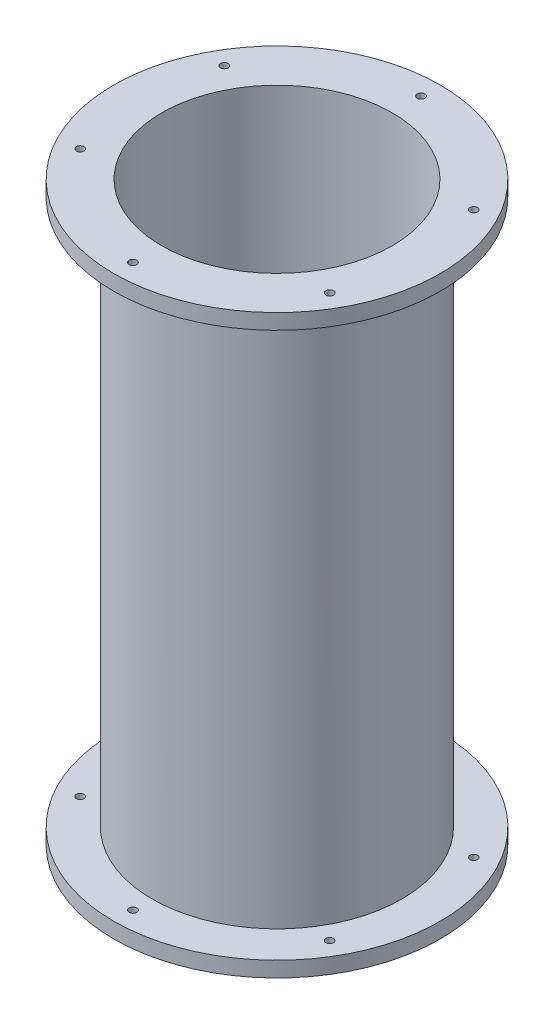
ISO-10303-21;
HEADER;
FILE_DESCRIPTION(('STEP AP214'),'2;1');
FILE_NAME('part.step','',(''),(''),'','','');
FILE_SCHEMA(('AUTOMOTIVE_DESIGN { 1 0 10303 214 1 1 1 1 }'));
ENDSEC;
DATA;
#1=APPLICATION_CONTEXT('core data for automotive mechanical design processes');
#2=APPLICATION_PROTOCOL_DEFINITION('international standard','automotive_design',2000,#1);
#3=PRODUCT_CONTEXT('',#1,'mechanical');
#4=PRODUCT('Part','Part','',(#3));
#5=PRODUCT_RELATED_PRODUCT_CATEGORY('part','',(#4));
#6=PRODUCT_DEFINITION_FORMATION('','',#4);
#7=PRODUCT_DEFINITION_CONTEXT('part definition',#1,'design');
#8=PRODUCT_DEFINITION('design','',#6,#7);
#9=PRODUCT_DEFINITION_SHAPE('','',#8);
#10=(LENGTH_UNIT() NAMED_UNIT(*) SI_UNIT(.MILLI.,.METRE.));
#11=(NAMED_UNIT(*) PLANE_ANGLE_UNIT() SI_UNIT($,.RADIAN.));
#12=(NAMED_UNIT(*) SI_UNIT($,.STERADIAN.) SOLID_ANGLE_UNIT());
#13=UNCERTAINTY_MEASURE_WITH_UNIT(LENGTH_MEASURE(1.E-05),#10,'distance_accuracy_value','');
#14=(GEOMETRIC_REPRESENTATION_CONTEXT(3) GLOBAL_UNCERTAINTY_ASSIGNED_CONTEXT((#13)) GLOBAL_UNIT_ASSIGNED_CONTEXT((#10,
#11,#12)) REPRESENTATION_CONTEXT('',''));
#15=CARTESIAN_POINT('',(0.,0.,0.));
#16=DIRECTION('',(0.,0.,1.));
#17=DIRECTION('',(1.,0.,0.));
#18=AXIS2_PLACEMENT_3D('',#15,#16,#17);
#19=CARTESIAN_POINT('',(0.,300.,0.));
#20=DIRECTION('',(0.,-1.,0.));
#21=DIRECTION('',(0.,0.,-1.));
#22=AXIS2_PLACEMENT_3D('',#19,#20,#21);
#23=CYLINDRICAL_SURFACE('',#22,65.);
#24=CARTESIAN_POINT('',(0.,292.,0.));
#25=DIRECTION('',(0.,1.,0.));
#26=DIRECTION('',(0.,0.,1.));
#27=AXIS2_PLACEMENT_3D('',#24,#25,#26);
#28=CIRCLE('',#27,65.);
#29=CARTESIAN_POINT('',(0.,292.,65.));
#30=VERTEX_POINT('',#29);
#31=EDGE_CURVE('E51',#30,#30,#28,.T.);
#32=ORIENTED_EDGE('',*,*,#31,.F.);
#33=EDGE_LOOP('',(#32));
#34=FACE_BOUND('',#33,.T.);
#35=CARTESIAN_POINT('',(0.,8.00000000000001,0.));
#36=DIRECTION('',(0.,-1.,0.));
#37=DIRECTION('',(0.,0.,-1.));
#38=AXIS2_PLACEMENT_3D('',#35,#36,#37);
#39=CIRCLE('',#38,65.);
#40=CARTESIAN_POINT('',(0.,8.00000000000001,-65.));
#41=VERTEX_POINT('',#40);
#42=EDGE_CURVE('E11',#41,#41,#39,.T.);
#43=ORIENTED_EDGE('',*,*,#42,.F.);
#44=EDGE_LOOP('',(#43));
#45=FACE_BOUND('',#44,.T.);
#46=ADVANCED_FACE('F43',(#34,#45),#23,.T.);
#47=CARTESIAN_POINT('',(0.,300.,0.));
#48=DIRECTION('',(0.,1.,0.));
#49=DIRECTION('',(0.,0.,1.));
#50=AXIS2_PLACEMENT_3D('',#47,#48,#49);
#51=PLANE('',#50);
#52=CARTESIAN_POINT('',(-64.9519052838281,300.,37.5000000000028));
#53=DIRECTION('',(0.,1.,0.));
#54=DIRECTION('',(0.,0.,1.));
#55=AXIS2_PLACEMENT_3D('',#52,#53,#54);
#56=CIRCLE('',#55,2.00000000000607);
#57=CARTESIAN_POINT('',(-64.9519052838281,300.,39.5000000000089));
#58=VERTEX_POINT('',#57);
#59=EDGE_CURVE('E115',#58,#58,#56,.T.);
#60=ORIENTED_EDGE('',*,*,#59,.F.);
#61=EDGE_LOOP('',(#60));
#62=FACE_BOUND('',#61,.T.);
#63=CARTESIAN_POINT('',(6.37773956665284E-12,300.,75.));
#64=DIRECTION('',(0.,1.,0.));
#65=DIRECTION('',(0.,0.,1.));
#66=AXIS2_PLACEMENT_3D('',#63,#64,#65);
#67=CIRCLE('',#66,2.0000000000066);
#68=CARTESIAN_POINT('',(6.37773956665284E-12,300.,77.0000000000067));
#69=VERTEX_POINT('',#68);
#70=EDGE_CURVE('E116',#69,#69,#67,.T.);
#71=ORIENTED_EDGE('',*,*,#70,.F.);
#72=EDGE_LOOP('',(#71));
#73=FACE_BOUND('',#72,.T.);
#74=CARTESIAN_POINT('',(0.,300.,-75.));
#75=DIRECTION('',(0.,1.,0.));
#76=DIRECTION('',(0.,0.,1.));
#77=AXIS2_PLACEMENT_3D('',#74,#75,#76);
#78=CIRCLE('',#77,2.);
#79=CARTESIAN_POINT('',(0.,300.,-73.));
#80=VERTEX_POINT('',#79);
#81=EDGE_CURVE('E120',#80,#80,#78,.T.);
#82=ORIENTED_EDGE('',*,*,#81,.F.);
#83=EDGE_LOOP('',(#82));
#84=FACE_BOUND('',#83,.T.);
#85=CARTESIAN_POINT('',(64.9519052838377,300.,37.4999999999973));
#86=DIRECTION('',(0.,1.,0.));
#87=DIRECTION('',(0.,0.,1.));
#88=AXIS2_PLACEMENT_3D('',#85,#86,#87);
#89=CIRCLE('',#88,2.00000000000411);
#90=CARTESIAN_POINT('',(64.9519052838377,300.,39.5000000000014));
#91=VERTEX_POINT('',#90);
#92=EDGE_CURVE('E124',#91,#91,#89,.T.);
#93=ORIENTED_EDGE('',*,*,#92,.F.);
#94=EDGE_LOOP('',(#93));
#95=FACE_BOUND('',#94,.T.);
#96=CARTESIAN_POINT('',(-64.9519052838314,300.,-37.4999999999972));
#97=DIRECTION('',(0.,1.,0.));
#98=DIRECTION('',(0.,0.,1.));
#99=AXIS2_PLACEMENT_3D('',#96,#97,#98);
#100=CIRCLE('',#99,2.00000000000322);
#101=CARTESIAN_POINT('',(-64.9519052838314,300.,-35.499999999994));
#102=VERTEX_POINT('',#101);
#103=EDGE_CURVE('E108',#102,#102,#100,.T.);
#104=ORIENTED_EDGE('',*,*,#103,.F.);
#105=EDGE_LOOP('',(#104));
#106=FACE_BOUND('',#105,.T.);
#107=CARTESIAN_POINT('',(64.9519052838345,300.,-37.5000000000028));
#108=DIRECTION('',(0.,1.,0.));
#109=DIRECTION('',(0.,0.,1.));
#110=AXIS2_PLACEMENT_3D('',#107,#108,#109);
#111=CIRCLE('',#110,2.0000000000009);
#112=CARTESIAN_POINT('',(64.9519052838345,300.,-35.5000000000019));
#113=VERTEX_POINT('',#112);
#114=EDGE_CURVE('E128',#113,#113,#111,.T.);
#115=ORIENTED_EDGE('',*,*,#114,.F.);
#116=EDGE_LOOP('',(#115));
#117=FACE_BOUND('',#116,.T.);
#118=CARTESIAN_POINT('',(0.,300.,0.));
#119=DIRECTION('',(0.,1.,0.));
#120=DIRECTION('',(1.,0.,0.));
#121=AXIS2_PLACEMENT_3D('',#118,#119,#120);
#122=CIRCLE('',#121,60.);
#123=CARTESIAN_POINT('',(60.,300.,0.));
#124=VERTEX_POINT('',#123);
#125=EDGE_CURVE('E57',#124,#124,#122,.T.);
#126=ORIENTED_EDGE('',*,*,#125,.F.);
#127=EDGE_LOOP('',(#126));
#128=FACE_BOUND('',#127,.T.);
#129=CARTESIAN_POINT('',(0.,300.,0.));
#130=DIRECTION('',(0.,1.,0.));
#131=DIRECTION('',(0.,0.,1.));
#132=AXIS2_PLACEMENT_3D('',#129,#130,#131);
#133=CIRCLE('',#132,85.);
#134=CARTESIAN_POINT('',(0.,300.,85.));
#135=VERTEX_POINT('',#134);
#136=EDGE_CURVE('E141',#135,#135,#133,.T.);
#137=ORIENTED_EDGE('',*,*,#136,.T.);
#138=EDGE_LOOP('',(#137));
#139=FACE_BOUND('',#138,.T.);
#140=ADVANCED_FACE('F194',(#62,#73,#84,#95,#106,#117,#128,#139),#51,.T.);
#141=CARTESIAN_POINT('',(0.,0.,0.));
#142=DIRECTION('',(0.,1.,0.));
#143=DIRECTION('',(0.,0.,1.));
#144=AXIS2_PLACEMENT_3D('',#141,#142,#143);
#145=PLANE('',#144);
#146=CARTESIAN_POINT('',(-64.9519052838282,0.,-37.5000000000028));
#147=DIRECTION('',(0.,1.,0.));
#148=DIRECTION('',(0.,0.,1.));
#149=AXIS2_PLACEMENT_3D('',#146,#147,#148);
#150=CIRCLE('',#149,2.00000000000607);
#151=CARTESIAN_POINT('',(-64.9519052838282,0.,-35.4999999999967));
#152=VERTEX_POINT('',#151);
#153=EDGE_CURVE('E99',#152,#152,#150,.T.);
#154=ORIENTED_EDGE('',*,*,#153,.T.);
#155=EDGE_LOOP('',(#154));
#156=FACE_BOUND('',#155,.T.);
#157=CARTESIAN_POINT('',(0.,0.,75.0000000000001));
#158=DIRECTION('',(0.,1.,0.));
#159=DIRECTION('',(0.,0.,1.));
#160=AXIS2_PLACEMENT_3D('',#157,#158,#159);
#161=CIRCLE('',#160,2.);
#162=CARTESIAN_POINT('',(0.,0.,77.0000000000001));
#163=VERTEX_POINT('',#162);
#164=EDGE_CURVE('E85',#163,#163,#161,.T.);
#165=ORIENTED_EDGE('',*,*,#164,.T.);
#166=EDGE_LOOP('',(#165));
#167=FACE_BOUND('',#166,.T.);
#168=CARTESIAN_POINT('',(6.37773956665284E-12,0.,-75.0000000000001));
#169=DIRECTION('',(0.,1.,0.));
#170=DIRECTION('',(0.,0.,1.));
#171=AXIS2_PLACEMENT_3D('',#168,#169,#170);
#172=CIRCLE('',#171,2.0000000000066);
#173=CARTESIAN_POINT('',(6.37773956665284E-12,0.,-72.9999999999934));
#174=VERTEX_POINT('',#173);
#175=EDGE_CURVE('E81',#174,#174,#172,.T.);
#176=ORIENTED_EDGE('',*,*,#175,.T.);
#177=EDGE_LOOP('',(#176));
#178=FACE_BOUND('',#177,.T.);
#179=CARTESIAN_POINT('',(64.9519052838377,0.,-37.4999999999973));
#180=DIRECTION('',(0.,1.,0.));
#181=DIRECTION('',(0.,0.,1.));
#182=AXIS2_PLACEMENT_3D('',#179,#180,#181);
#183=CIRCLE('',#182,2.00000000000412);
#184=CARTESIAN_POINT('',(64.9519052838377,0.,-35.4999999999931));
#185=VERTEX_POINT('',#184);
#186=EDGE_CURVE('E77',#185,#185,#183,.T.);
#187=ORIENTED_EDGE('',*,*,#186,.T.);
#188=EDGE_LOOP('',(#187));
#189=FACE_BOUND('',#188,.T.);
#190=CARTESIAN_POINT('',(-64.9519052838314,0.,37.4999999999972));
#191=DIRECTION('',(0.,1.,0.));
#192=DIRECTION('',(0.,0.,1.));
#193=AXIS2_PLACEMENT_3D('',#190,#191,#192);
#194=CIRCLE('',#193,2.00000000000322);
#195=CARTESIAN_POINT('',(-64.9519052838314,0.,39.5000000000004));
#196=VERTEX_POINT('',#195);
#197=EDGE_CURVE('E72',#196,#196,#194,.T.);
#198=ORIENTED_EDGE('',*,*,#197,.T.);
#199=EDGE_LOOP('',(#198));
#200=FACE_BOUND('',#199,.T.);
#201=CARTESIAN_POINT('',(64.9519052838345,0.,37.5000000000028));
#202=DIRECTION('',(0.,1.,0.));
#203=DIRECTION('',(0.,0.,1.));
#204=AXIS2_PLACEMENT_3D('',#201,#202,#203);
#205=CIRCLE('',#204,2.0000000000009);
#206=CARTESIAN_POINT('',(64.9519052838345,0.,39.5000000000037));
#207=VERTEX_POINT('',#206);
#208=EDGE_CURVE('E67',#207,#207,#205,.T.);
#209=ORIENTED_EDGE('',*,*,#208,.T.);
#210=EDGE_LOOP('',(#209));
#211=FACE_BOUND('',#210,.T.);
#212=CARTESIAN_POINT('',(0.,0.,0.));
#213=DIRECTION('',(0.,1.,0.));
#214=DIRECTION('',(1.,0.,0.));
#215=AXIS2_PLACEMENT_3D('',#212,#213,#214);
#216=CIRCLE('',#215,60.);
#217=CARTESIAN_POINT('',(60.,0.,0.));
#218=VERTEX_POINT('',#217);
#219=EDGE_CURVE('E140',#218,#218,#216,.T.);
#220=ORIENTED_EDGE('',*,*,#219,.T.);
#221=EDGE_LOOP('',(#220));
#222=FACE_BOUND('',#221,.T.);
#223=CARTESIAN_POINT('',(0.,0.,0.));
#224=DIRECTION('',(0.,-1.,0.));
#225=DIRECTION('',(0.,0.,-1.));
#226=AXIS2_PLACEMENT_3D('',#223,#224,#225);
#227=CIRCLE('',#226,85.);
#228=CARTESIAN_POINT('',(0.,0.,-85.));
#229=VERTEX_POINT('',#228);
#230=EDGE_CURVE('E103',#229,#229,#227,.T.);
#231=ORIENTED_EDGE('',*,*,#230,.T.);
#232=EDGE_LOOP('',(#231));
#233=FACE_BOUND('',#232,.T.);
#234=ADVANCED_FACE('F199',(#156,#167,#178,#189,#200,#211,#222,#233),#145,.F.);
#235=CARTESIAN_POINT('',(0.,300.,0.));
#236=DIRECTION('',(0.,-1.,0.));
#237=DIRECTION('',(0.,0.,-1.));
#238=AXIS2_PLACEMENT_3D('',#235,#236,#237);
#239=CYLINDRICAL_SURFACE('',#238,60.);
#240=ORIENTED_EDGE('',*,*,#125,.T.);
#241=EDGE_LOOP('',(#240));
#242=FACE_BOUND('',#241,.T.);
#243=ORIENTED_EDGE('',*,*,#219,.F.);
#244=EDGE_LOOP('',(#243));
#245=FACE_BOUND('',#244,.T.);
#246=ADVANCED_FACE('F214',(#242,#245),#239,.F.);
#247=CARTESIAN_POINT('',(0.,292.,0.));
#248=DIRECTION('',(0.,1.,0.));
#249=DIRECTION('',(0.,0.,1.));
#250=AXIS2_PLACEMENT_3D('',#247,#248,#249);
#251=CYLINDRICAL_SURFACE('',#250,85.);
#252=CARTESIAN_POINT('',(0.,292.,0.));
#253=DIRECTION('',(0.,1.,0.));
#254=DIRECTION('',(0.,0.,1.));
#255=AXIS2_PLACEMENT_3D('',#252,#253,#254);
#256=CIRCLE('',#255,85.);
#257=CARTESIAN_POINT('',(0.,292.,85.));
#258=VERTEX_POINT('',#257);
#259=EDGE_CURVE('E136',#258,#258,#256,.T.);
#260=ORIENTED_EDGE('',*,*,#259,.T.);
#261=EDGE_LOOP('',(#260));
#262=FACE_BOUND('',#261,.T.);
#263=ORIENTED_EDGE('',*,*,#136,.F.);
#264=EDGE_LOOP('',(#263));
#265=FACE_BOUND('',#264,.T.);
#266=ADVANCED_FACE('F208',(#262,#265),#251,.T.);
#267=CARTESIAN_POINT('',(0.,292.,0.));
#268=DIRECTION('',(0.,1.,0.));
#269=DIRECTION('',(0.,0.,1.));
#270=AXIS2_PLACEMENT_3D('',#267,#268,#269);
#271=PLANE('',#270);
#272=CARTESIAN_POINT('',(-64.9519052838281,292.,37.5000000000028));
#273=DIRECTION('',(0.,1.,0.));
#274=DIRECTION('',(0.,0.,1.));
#275=AXIS2_PLACEMENT_3D('',#272,#273,#274);
#276=CIRCLE('',#275,2.00000000000607);
#277=CARTESIAN_POINT('',(-64.9519052838281,292.,39.5000000000089));
#278=VERTEX_POINT('',#277);
#279=EDGE_CURVE('E61',#278,#278,#276,.T.);
#280=ORIENTED_EDGE('',*,*,#279,.T.);
#281=EDGE_LOOP('',(#280));
#282=FACE_BOUND('',#281,.T.);
#283=CARTESIAN_POINT('',(6.37773956665284E-12,292.,75.));
#284=DIRECTION('',(0.,1.,0.));
#285=DIRECTION('',(0.,0.,1.));
#286=AXIS2_PLACEMENT_3D('',#283,#284,#285);
#287=CIRCLE('',#286,2.0000000000066);
#288=CARTESIAN_POINT('',(6.37773956665284E-12,292.,77.0000000000067));
#289=VERTEX_POINT('',#288);
#290=EDGE_CURVE('E165',#289,#289,#287,.T.);
#291=ORIENTED_EDGE('',*,*,#290,.T.);
#292=EDGE_LOOP('',(#291));
#293=FACE_BOUND('',#292,.T.);
#294=CARTESIAN_POINT('',(0.,292.,-75.));
#295=DIRECTION('',(0.,1.,0.));
#296=DIRECTION('',(0.,0.,1.));
#297=AXIS2_PLACEMENT_3D('',#294,#295,#296);
#298=CIRCLE('',#297,2.);
#299=CARTESIAN_POINT('',(0.,292.,-73.));
#300=VERTEX_POINT('',#299);
#301=EDGE_CURVE('E162',#300,#300,#298,.T.);
#302=ORIENTED_EDGE('',*,*,#301,.T.);
#303=EDGE_LOOP('',(#302));
#304=FACE_BOUND('',#303,.T.);
#305=CARTESIAN_POINT('',(64.9519052838377,292.,37.4999999999973));
#306=DIRECTION('',(0.,1.,0.));
#307=DIRECTION('',(0.,0.,1.));
#308=AXIS2_PLACEMENT_3D('',#305,#306,#307);
#309=CIRCLE('',#308,2.00000000000411);
#310=CARTESIAN_POINT('',(64.9519052838377,292.,39.5000000000014));
#311=VERTEX_POINT('',#310);
#312=EDGE_CURVE('E158',#311,#311,#309,.T.);
#313=ORIENTED_EDGE('',*,*,#312,.T.);
#314=EDGE_LOOP('',(#313));
#315=FACE_BOUND('',#314,.T.);
#316=CARTESIAN_POINT('',(-64.9519052838314,292.,-37.4999999999972));
#317=DIRECTION('',(0.,1.,0.));
#318=DIRECTION('',(0.,0.,1.));
#319=AXIS2_PLACEMENT_3D('',#316,#317,#318);
#320=CIRCLE('',#319,2.00000000000322);
#321=CARTESIAN_POINT('',(-64.9519052838314,292.,-35.499999999994));
#322=VERTEX_POINT('',#321);
#323=EDGE_CURVE('E154',#322,#322,#320,.T.);
#324=ORIENTED_EDGE('',*,*,#323,.T.);
#325=EDGE_LOOP('',(#324));
#326=FACE_BOUND('',#325,.T.);
#327=CARTESIAN_POINT('',(64.9519052838345,292.,-37.5000000000028));
#328=DIRECTION('',(0.,1.,0.));
#329=DIRECTION('',(0.,0.,1.));
#330=AXIS2_PLACEMENT_3D('',#327,#328,#329);
#331=CIRCLE('',#330,2.0000000000009);
#332=CARTESIAN_POINT('',(64.9519052838345,292.,-35.5000000000019));
#333=VERTEX_POINT('',#332);
#334=EDGE_CURVE('E135',#333,#333,#331,.T.);
#335=ORIENTED_EDGE('',*,*,#334,.T.);
#336=EDGE_LOOP('',(#335));
#337=FACE_BOUND('',#336,.T.);
#338=ORIENTED_EDGE('',*,*,#31,.T.);
#339=EDGE_LOOP('',(#338));
#340=FACE_BOUND('',#339,.T.);
#341=ORIENTED_EDGE('',*,*,#259,.F.);
#342=EDGE_LOOP('',(#341));
#343=FACE_BOUND('',#342,.T.);
#344=ADVANCED_FACE('F174',(#282,#293,#304,#315,#326,#337,#340,#343),#271,.F.);
#345=CARTESIAN_POINT('',(64.9519052838345,0.,-37.5000000000028));
#346=DIRECTION('',(0.,1.,0.));
#347=DIRECTION('',(0.,0.,1.));
#348=AXIS2_PLACEMENT_3D('',#345,#346,#347);
#349=CYLINDRICAL_SURFACE('',#348,2.0000000000009);
#350=ORIENTED_EDGE('',*,*,#114,.T.);
#351=EDGE_LOOP('',(#350));
#352=FACE_BOUND('',#351,.T.);
#353=ORIENTED_EDGE('',*,*,#334,.F.);
#354=EDGE_LOOP('',(#353));
#355=FACE_BOUND('',#354,.T.);
#356=ADVANCED_FACE('F207',(#352,#355),#349,.F.);
#357=CARTESIAN_POINT('',(-64.9519052838314,0.,-37.4999999999972));
#358=DIRECTION('',(0.,1.,0.));
#359=DIRECTION('',(0.,0.,1.));
#360=AXIS2_PLACEMENT_3D('',#357,#358,#359);
#361=CYLINDRICAL_SURFACE('',#360,2.00000000000322);
#362=ORIENTED_EDGE('',*,*,#103,.T.);
#363=EDGE_LOOP('',(#362));
#364=FACE_BOUND('',#363,.T.);
#365=ORIENTED_EDGE('',*,*,#323,.F.);
#366=EDGE_LOOP('',(#365));
#367=FACE_BOUND('',#366,.T.);
#368=ADVANCED_FACE('F270',(#364,#367),#361,.F.);
#369=CARTESIAN_POINT('',(64.9519052838377,0.,37.4999999999973));
#370=DIRECTION('',(0.,1.,0.));
#371=DIRECTION('',(0.,0.,1.));
#372=AXIS2_PLACEMENT_3D('',#369,#370,#371);
#373=CYLINDRICAL_SURFACE('',#372,2.00000000000411);
#374=ORIENTED_EDGE('',*,*,#92,.T.);
#375=EDGE_LOOP('',(#374));
#376=FACE_BOUND('',#375,.T.);
#377=ORIENTED_EDGE('',*,*,#312,.F.);
#378=EDGE_LOOP('',(#377));
#379=FACE_BOUND('',#378,.T.);
#380=ADVANCED_FACE('F272',(#376,#379),#373,.F.);
#381=CARTESIAN_POINT('',(0.,0.,-75.));
#382=DIRECTION('',(0.,1.,0.));
#383=DIRECTION('',(0.,0.,1.));
#384=AXIS2_PLACEMENT_3D('',#381,#382,#383);
#385=CYLINDRICAL_SURFACE('',#384,2.);
#386=ORIENTED_EDGE('',*,*,#81,.T.);
#387=EDGE_LOOP('',(#386));
#388=FACE_BOUND('',#387,.T.);
#389=ORIENTED_EDGE('',*,*,#301,.F.);
#390=EDGE_LOOP('',(#389));
#391=FACE_BOUND('',#390,.T.);
#392=ADVANCED_FACE('F189',(#388,#391),#385,.F.);
#393=CARTESIAN_POINT('',(6.37773956665284E-12,0.,75.));
#394=DIRECTION('',(0.,1.,0.));
#395=DIRECTION('',(0.,0.,1.));
#396=AXIS2_PLACEMENT_3D('',#393,#394,#395);
#397=CYLINDRICAL_SURFACE('',#396,2.0000000000066);
#398=ORIENTED_EDGE('',*,*,#70,.T.);
#399=EDGE_LOOP('',(#398));
#400=FACE_BOUND('',#399,.T.);
#401=ORIENTED_EDGE('',*,*,#290,.F.);
#402=EDGE_LOOP('',(#401));
#403=FACE_BOUND('',#402,.T.);
#404=ADVANCED_FACE('F179',(#400,#403),#397,.F.);
#405=CARTESIAN_POINT('',(-64.9519052838281,0.,37.5000000000028));
#406=DIRECTION('',(0.,1.,0.));
#407=DIRECTION('',(0.,0.,1.));
#408=AXIS2_PLACEMENT_3D('',#405,#406,#407);
#409=CYLINDRICAL_SURFACE('',#408,2.00000000000607);
#410=ORIENTED_EDGE('',*,*,#59,.T.);
#411=EDGE_LOOP('',(#410));
#412=FACE_BOUND('',#411,.T.);
#413=ORIENTED_EDGE('',*,*,#279,.F.);
#414=EDGE_LOOP('',(#413));
#415=FACE_BOUND('',#414,.T.);
#416=ADVANCED_FACE('F176',(#412,#415),#409,.F.);
#417=CARTESIAN_POINT('',(0.,8.,0.));
#418=DIRECTION('',(0.,-1.,0.));
#419=DIRECTION('',(0.,0.,-1.));
#420=AXIS2_PLACEMENT_3D('',#417,#418,#419);
#421=CYLINDRICAL_SURFACE('',#420,85.);
#422=CARTESIAN_POINT('',(0.,8.,0.));
#423=DIRECTION('',(0.,-1.,0.));
#424=DIRECTION('',(0.,0.,-1.));
#425=AXIS2_PLACEMENT_3D('',#422,#423,#424);
#426=CIRCLE('',#425,85.);
#427=CARTESIAN_POINT('',(0.,8.,-85.));
#428=VERTEX_POINT('',#427);
#429=EDGE_CURVE('E104',#428,#428,#426,.T.);
#430=ORIENTED_EDGE('',*,*,#429,.T.);
#431=EDGE_LOOP('',(#430));
#432=FACE_BOUND('',#431,.T.);
#433=ORIENTED_EDGE('',*,*,#230,.F.);
#434=EDGE_LOOP('',(#433));
#435=FACE_BOUND('',#434,.T.);
#436=ADVANCED_FACE('F178',(#432,#435),#421,.T.);
#437=CARTESIAN_POINT('',(0.,8.,0.));
#438=DIRECTION('',(0.,-1.,0.));
#439=DIRECTION('',(0.,0.,-1.));
#440=AXIS2_PLACEMENT_3D('',#437,#438,#439);
#441=PLANE('',#440);
#442=CARTESIAN_POINT('',(-64.9519052838282,8.00000000000001,-37.5000000000028));
#443=DIRECTION('',(0.,-1.,0.));
#444=DIRECTION('',(0.,0.,-1.));
#445=AXIS2_PLACEMENT_3D('',#442,#443,#444);
#446=CIRCLE('',#445,2.00000000000607);
#447=CARTESIAN_POINT('',(-64.9519052838282,8.00000000000001,-39.5000000000089));
#448=VERTEX_POINT('',#447);
#449=EDGE_CURVE('E46',#448,#448,#446,.T.);
#450=ORIENTED_EDGE('',*,*,#449,.T.);
#451=EDGE_LOOP('',(#450));
#452=FACE_BOUND('',#451,.T.);
#453=CARTESIAN_POINT('',(0.,8.00000000000001,75.0000000000001));
#454=DIRECTION('',(0.,-1.,0.));
#455=DIRECTION('',(0.,0.,-1.));
#456=AXIS2_PLACEMENT_3D('',#453,#454,#455);
#457=CIRCLE('',#456,2.);
#458=CARTESIAN_POINT('',(0.,8.00000000000001,73.0000000000001));
#459=VERTEX_POINT('',#458);
#460=EDGE_CURVE('E82',#459,#459,#457,.T.);
#461=ORIENTED_EDGE('',*,*,#460,.T.);
#462=EDGE_LOOP('',(#461));
#463=FACE_BOUND('',#462,.T.);
#464=CARTESIAN_POINT('',(6.37773956665284E-12,8.00000000000001,-75.0000000000001));
#465=DIRECTION('',(0.,-1.,0.));
#466=DIRECTION('',(0.,0.,-1.));
#467=AXIS2_PLACEMENT_3D('',#464,#465,#466);
#468=CIRCLE('',#467,2.0000000000066);
#469=CARTESIAN_POINT('',(6.37773956665284E-12,8.00000000000001,-77.0000000000067));
#470=VERTEX_POINT('',#469);
#471=EDGE_CURVE('E78',#470,#470,#468,.T.);
#472=ORIENTED_EDGE('',*,*,#471,.T.);
#473=EDGE_LOOP('',(#472));
#474=FACE_BOUND('',#473,.T.);
#475=CARTESIAN_POINT('',(64.9519052838377,8.00000000000001,-37.4999999999973));
#476=DIRECTION('',(0.,-1.,0.));
#477=DIRECTION('',(0.,0.,-1.));
#478=AXIS2_PLACEMENT_3D('',#475,#476,#477);
#479=CIRCLE('',#478,2.00000000000412);
#480=CARTESIAN_POINT('',(64.9519052838377,8.00000000000001,-39.5000000000014));
#481=VERTEX_POINT('',#480);
#482=EDGE_CURVE('E73',#481,#481,#479,.T.);
#483=ORIENTED_EDGE('',*,*,#482,.T.);
#484=EDGE_LOOP('',(#483));
#485=FACE_BOUND('',#484,.T.);
#486=CARTESIAN_POINT('',(-64.9519052838314,8.00000000000001,37.4999999999972));
#487=DIRECTION('',(0.,-1.,0.));
#488=DIRECTION('',(0.,0.,-1.));
#489=AXIS2_PLACEMENT_3D('',#486,#487,#488);
#490=CIRCLE('',#489,2.00000000000322);
#491=CARTESIAN_POINT('',(-64.9519052838314,8.00000000000001,35.499999999994));
#492=VERTEX_POINT('',#491);
#493=EDGE_CURVE('E68',#492,#492,#490,.T.);
#494=ORIENTED_EDGE('',*,*,#493,.T.);
#495=EDGE_LOOP('',(#494));
#496=FACE_BOUND('',#495,.T.);
#497=CARTESIAN_POINT('',(64.9519052838345,8.00000000000001,37.5000000000028));
#498=DIRECTION('',(0.,-1.,0.));
#499=DIRECTION('',(0.,0.,-1.));
#500=AXIS2_PLACEMENT_3D('',#497,#498,#499);
#501=CIRCLE('',#500,2.0000000000009);
#502=CARTESIAN_POINT('',(64.9519052838345,8.00000000000001,35.5000000000019));
#503=VERTEX_POINT('',#502);
#504=EDGE_CURVE('E63',#503,#503,#501,.T.);
#505=ORIENTED_EDGE('',*,*,#504,.T.);
#506=EDGE_LOOP('',(#505));
#507=FACE_BOUND('',#506,.T.);
#508=ORIENTED_EDGE('',*,*,#42,.T.);
#509=EDGE_LOOP('',(#508));
#510=FACE_BOUND('',#509,.T.);
#511=ORIENTED_EDGE('',*,*,#429,.F.);
#512=EDGE_LOOP('',(#511));
#513=FACE_BOUND('',#512,.T.);
#514=ADVANCED_FACE('F186',(#452,#463,#474,#485,#496,#507,#510,#513),#441,.F.);
#515=CARTESIAN_POINT('',(64.9519052838345,300.,37.5000000000028));
#516=DIRECTION('',(0.,-1.,0.));
#517=DIRECTION('',(0.,0.,-1.));
#518=AXIS2_PLACEMENT_3D('',#515,#516,#517);
#519=CYLINDRICAL_SURFACE('',#518,2.0000000000009);
#520=ORIENTED_EDGE('',*,*,#504,.F.);
#521=EDGE_LOOP('',(#520));
#522=FACE_BOUND('',#521,.T.);
#523=ORIENTED_EDGE('',*,*,#208,.F.);
#524=EDGE_LOOP('',(#523));
#525=FACE_BOUND('',#524,.T.);
#526=ADVANCED_FACE('F251',(#522,#525),#519,.F.);
#527=CARTESIAN_POINT('',(-64.9519052838314,300.,37.4999999999972));
#528=DIRECTION('',(0.,-1.,0.));
#529=DIRECTION('',(0.,0.,-1.));
#530=AXIS2_PLACEMENT_3D('',#527,#528,#529);
#531=CYLINDRICAL_SURFACE('',#530,2.00000000000322);
#532=ORIENTED_EDGE('',*,*,#493,.F.);
#533=EDGE_LOOP('',(#532));
#534=FACE_BOUND('',#533,.T.);
#535=ORIENTED_EDGE('',*,*,#197,.F.);
#536=EDGE_LOOP('',(#535));
#537=FACE_BOUND('',#536,.T.);
#538=ADVANCED_FACE('F253',(#534,#537),#531,.F.);
#539=CARTESIAN_POINT('',(64.9519052838377,300.,-37.4999999999973));
#540=DIRECTION('',(0.,-1.,0.));
#541=DIRECTION('',(0.,0.,-1.));
#542=AXIS2_PLACEMENT_3D('',#539,#540,#541);
#543=CYLINDRICAL_SURFACE('',#542,2.00000000000412);
#544=ORIENTED_EDGE('',*,*,#482,.F.);
#545=EDGE_LOOP('',(#544));
#546=FACE_BOUND('',#545,.T.);
#547=ORIENTED_EDGE('',*,*,#186,.F.);
#548=EDGE_LOOP('',(#547));
#549=FACE_BOUND('',#548,.T.);
#550=ADVANCED_FACE('F260',(#546,#549),#543,.F.);
#551=CARTESIAN_POINT('',(6.37773956665284E-12,300.,-75.0000000000001));
#552=DIRECTION('',(0.,-1.,0.));
#553=DIRECTION('',(0.,0.,-1.));
#554=AXIS2_PLACEMENT_3D('',#551,#552,#553);
#555=CYLINDRICAL_SURFACE('',#554,2.0000000000066);
#556=ORIENTED_EDGE('',*,*,#471,.F.);
#557=EDGE_LOOP('',(#556));
#558=FACE_BOUND('',#557,.T.);
#559=ORIENTED_EDGE('',*,*,#175,.F.);
#560=EDGE_LOOP('',(#559));
#561=FACE_BOUND('',#560,.T.);
#562=ADVANCED_FACE('F267',(#558,#561),#555,.F.);
#563=CARTESIAN_POINT('',(0.,300.,75.0000000000001));
#564=DIRECTION('',(0.,-1.,0.));
#565=DIRECTION('',(0.,0.,-1.));
#566=AXIS2_PLACEMENT_3D('',#563,#564,#565);
#567=CYLINDRICAL_SURFACE('',#566,2.);
#568=ORIENTED_EDGE('',*,*,#460,.F.);
#569=EDGE_LOOP('',(#568));
#570=FACE_BOUND('',#569,.T.);
#571=ORIENTED_EDGE('',*,*,#164,.F.);
#572=EDGE_LOOP('',(#571));
#573=FACE_BOUND('',#572,.T.);
#574=ADVANCED_FACE('F367',(#570,#573),#567,.F.);
#575=CARTESIAN_POINT('',(-64.9519052838282,300.,-37.5000000000028));
#576=DIRECTION('',(0.,-1.,0.));
#577=DIRECTION('',(0.,0.,-1.));
#578=AXIS2_PLACEMENT_3D('',#575,#576,#577);
#579=CYLINDRICAL_SURFACE('',#578,2.00000000000607);
#580=ORIENTED_EDGE('',*,*,#449,.F.);
#581=EDGE_LOOP('',(#580));
#582=FACE_BOUND('',#581,.T.);
#583=ORIENTED_EDGE('',*,*,#153,.F.);
#584=EDGE_LOOP('',(#583));
#585=FACE_BOUND('',#584,.T.);
#586=ADVANCED_FACE('F376',(#582,#585),#579,.F.);
#587=CLOSED_SHELL('',(#46,#140,#234,#246,#266,#344,#356,#368,#380,#392,#404,#416,#436,#514,#526,
#538,#550,#562,#574,#586));
#588=MANIFOLD_SOLID_BREP('B2',#587);
#589=ADVANCED_BREP_SHAPE_REPRESENTATION('',(#18,#588),#14);
#590=SHAPE_DEFINITION_REPRESENTATION(#9,#589);
ENDSEC;
END-ISO-10303-21;
